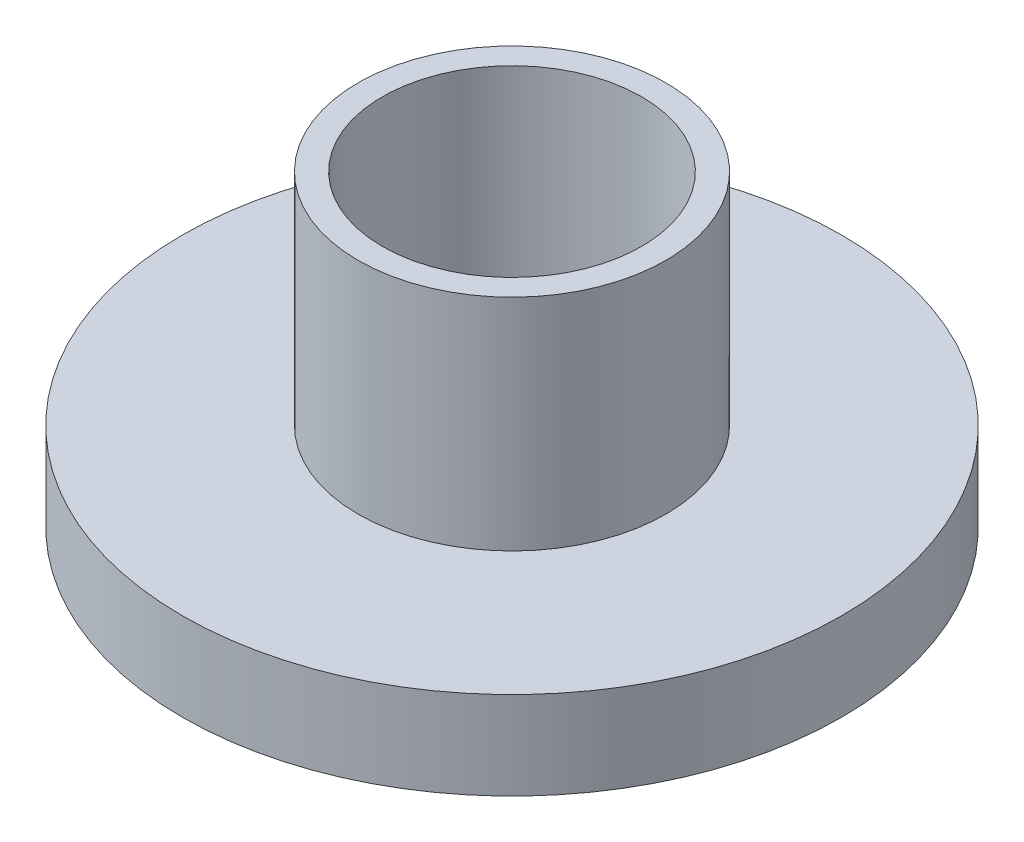
ISO-10303-21;
HEADER;
FILE_DESCRIPTION(('STEP AP214'),'2;1');
FILE_NAME('part.step','',(''),(''),'','','');
FILE_SCHEMA(('AUTOMOTIVE_DESIGN { 1 0 10303 214 1 1 1 1 }'));
ENDSEC;
DATA;
#1=APPLICATION_CONTEXT('core data for automotive mechanical design processes');
#2=APPLICATION_PROTOCOL_DEFINITION('international standard','automotive_design',2000,#1);
#3=PRODUCT_CONTEXT('',#1,'mechanical');
#4=PRODUCT('Part','Part','',(#3));
#5=PRODUCT_RELATED_PRODUCT_CATEGORY('part','',(#4));
#6=PRODUCT_DEFINITION_FORMATION('','',#4);
#7=PRODUCT_DEFINITION_CONTEXT('part definition',#1,'design');
#8=PRODUCT_DEFINITION('design','',#6,#7);
#9=PRODUCT_DEFINITION_SHAPE('','',#8);
#10=(LENGTH_UNIT() NAMED_UNIT(*) SI_UNIT(.MILLI.,.METRE.));
#11=(NAMED_UNIT(*) PLANE_ANGLE_UNIT() SI_UNIT($,.RADIAN.));
#12=(NAMED_UNIT(*) SI_UNIT($,.STERADIAN.) SOLID_ANGLE_UNIT());
#13=UNCERTAINTY_MEASURE_WITH_UNIT(LENGTH_MEASURE(1.E-05),#10,'distance_accuracy_value','');
#14=(GEOMETRIC_REPRESENTATION_CONTEXT(3) GLOBAL_UNCERTAINTY_ASSIGNED_CONTEXT((#13)) GLOBAL_UNIT_ASSIGNED_CONTEXT((#10,
#11,#12)) REPRESENTATION_CONTEXT('',''));
#15=CARTESIAN_POINT('',(0.,0.,0.));
#16=DIRECTION('',(0.,0.,1.));
#17=DIRECTION('',(1.,0.,0.));
#18=AXIS2_PLACEMENT_3D('',#15,#16,#17);
#19=CARTESIAN_POINT('',(0.,2.,0.));
#20=DIRECTION('',(0.,-1.,0.));
#21=DIRECTION('',(0.,0.,-1.));
#22=AXIS2_PLACEMENT_3D('',#19,#20,#21);
#23=CYLINDRICAL_SURFACE('',#22,7.5);
#24=CARTESIAN_POINT('',(0.,2.,0.));
#25=DIRECTION('',(0.,1.,0.));
#26=DIRECTION('',(0.,0.,1.));
#27=AXIS2_PLACEMENT_3D('',#24,#25,#26);
#28=CIRCLE('',#27,7.5);
#29=CARTESIAN_POINT('',(0.,2.,7.5));
#30=VERTEX_POINT('',#29);
#31=EDGE_CURVE('E49',#30,#30,#28,.T.);
#32=ORIENTED_EDGE('',*,*,#31,.F.);
#33=EDGE_LOOP('',(#32));
#34=FACE_BOUND('',#33,.T.);
#35=CARTESIAN_POINT('',(0.,0.,0.));
#36=DIRECTION('',(0.,1.,0.));
#37=DIRECTION('',(0.,0.,1.));
#38=AXIS2_PLACEMENT_3D('',#35,#36,#37);
#39=CIRCLE('',#38,7.5);
#40=CARTESIAN_POINT('',(0.,0.,7.5));
#41=VERTEX_POINT('',#40);
#42=EDGE_CURVE('E44',#41,#41,#39,.T.);
#43=ORIENTED_EDGE('',*,*,#42,.T.);
#44=EDGE_LOOP('',(#43));
#45=FACE_BOUND('',#44,.T.);
#46=ADVANCED_FACE('F41',(#34,#45),#23,.T.);
#47=CARTESIAN_POINT('',(0.,2.,0.));
#48=DIRECTION('',(0.,1.,0.));
#49=DIRECTION('',(0.,0.,1.));
#50=AXIS2_PLACEMENT_3D('',#47,#48,#49);
#51=PLANE('',#50);
#52=CARTESIAN_POINT('',(0.,2.,0.));
#53=DIRECTION('',(0.,1.,0.));
#54=DIRECTION('',(0.,0.,1.));
#55=AXIS2_PLACEMENT_3D('',#52,#53,#54);
#56=CIRCLE('',#55,3.5);
#57=CARTESIAN_POINT('',(0.,2.,3.5));
#58=VERTEX_POINT('',#57);
#59=EDGE_CURVE('E10',#58,#58,#56,.T.);
#60=ORIENTED_EDGE('',*,*,#59,.F.);
#61=EDGE_LOOP('',(#60));
#62=FACE_BOUND('',#61,.T.);
#63=ORIENTED_EDGE('',*,*,#31,.T.);
#64=EDGE_LOOP('',(#63));
#65=FACE_BOUND('',#64,.T.);
#66=ADVANCED_FACE('F85',(#62,#65),#51,.T.);
#67=CARTESIAN_POINT('',(0.,0.,0.));
#68=DIRECTION('',(0.,1.,0.));
#69=DIRECTION('',(0.,0.,1.));
#70=AXIS2_PLACEMENT_3D('',#67,#68,#69);
#71=PLANE('',#70);
#72=CARTESIAN_POINT('',(0.,0.,0.));
#73=DIRECTION('',(0.,1.,0.));
#74=DIRECTION('',(0.,0.,1.));
#75=AXIS2_PLACEMENT_3D('',#72,#73,#74);
#76=CIRCLE('',#75,2.95);
#77=CARTESIAN_POINT('',(0.,0.,2.95));
#78=VERTEX_POINT('',#77);
#79=EDGE_CURVE('E60',#78,#78,#76,.T.);
#80=ORIENTED_EDGE('',*,*,#79,.T.);
#81=EDGE_LOOP('',(#80));
#82=FACE_BOUND('',#81,.T.);
#83=ORIENTED_EDGE('',*,*,#42,.F.);
#84=EDGE_LOOP('',(#83));
#85=FACE_BOUND('',#84,.T.);
#86=ADVANCED_FACE('F80',(#82,#85),#71,.F.);
#87=CARTESIAN_POINT('',(0.,7.,0.));
#88=DIRECTION('',(0.,-1.,0.));
#89=DIRECTION('',(0.,0.,-1.));
#90=AXIS2_PLACEMENT_3D('',#87,#88,#89);
#91=CYLINDRICAL_SURFACE('',#90,3.5);
#92=CARTESIAN_POINT('',(0.,7.,0.));
#93=DIRECTION('',(0.,1.,0.));
#94=DIRECTION('',(0.,0.,1.));
#95=AXIS2_PLACEMENT_3D('',#92,#93,#94);
#96=CIRCLE('',#95,3.5);
#97=CARTESIAN_POINT('',(0.,7.,3.5));
#98=VERTEX_POINT('',#97);
#99=EDGE_CURVE('E56',#98,#98,#96,.T.);
#100=ORIENTED_EDGE('',*,*,#99,.F.);
#101=EDGE_LOOP('',(#100));
#102=FACE_BOUND('',#101,.T.);
#103=ORIENTED_EDGE('',*,*,#59,.T.);
#104=EDGE_LOOP('',(#103));
#105=FACE_BOUND('',#104,.T.);
#106=ADVANCED_FACE('F75',(#102,#105),#91,.T.);
#107=CARTESIAN_POINT('',(0.,7.,0.));
#108=DIRECTION('',(0.,1.,0.));
#109=DIRECTION('',(0.,0.,1.));
#110=AXIS2_PLACEMENT_3D('',#107,#108,#109);
#111=PLANE('',#110);
#112=CARTESIAN_POINT('',(0.,7.,0.));
#113=DIRECTION('',(0.,1.,0.));
#114=DIRECTION('',(0.,0.,1.));
#115=AXIS2_PLACEMENT_3D('',#112,#113,#114);
#116=CIRCLE('',#115,2.95);
#117=CARTESIAN_POINT('',(0.,7.,2.95));
#118=VERTEX_POINT('',#117);
#119=EDGE_CURVE('E64',#118,#118,#116,.T.);
#120=ORIENTED_EDGE('',*,*,#119,.F.);
#121=EDGE_LOOP('',(#120));
#122=FACE_BOUND('',#121,.T.);
#123=ORIENTED_EDGE('',*,*,#99,.T.);
#124=EDGE_LOOP('',(#123));
#125=FACE_BOUND('',#124,.T.);
#126=ADVANCED_FACE('F72',(#122,#125),#111,.T.);
#127=CARTESIAN_POINT('',(0.,-7.,0.));
#128=DIRECTION('',(0.,1.,0.));
#129=DIRECTION('',(0.,0.,1.));
#130=AXIS2_PLACEMENT_3D('',#127,#128,#129);
#131=CYLINDRICAL_SURFACE('',#130,2.95);
#132=ORIENTED_EDGE('',*,*,#119,.T.);
#133=EDGE_LOOP('',(#132));
#134=FACE_BOUND('',#133,.T.);
#135=ORIENTED_EDGE('',*,*,#79,.F.);
#136=EDGE_LOOP('',(#135));
#137=FACE_BOUND('',#136,.T.);
#138=ADVANCED_FACE('F69',(#134,#137),#131,.F.);
#139=CLOSED_SHELL('',(#46,#66,#86,#106,#126,#138));
#140=MANIFOLD_SOLID_BREP('B2',#139);
#141=ADVANCED_BREP_SHAPE_REPRESENTATION('',(#18,#140),#14);
#142=SHAPE_DEFINITION_REPRESENTATION(#9,#141);
ENDSEC;
END-ISO-10303-21;
